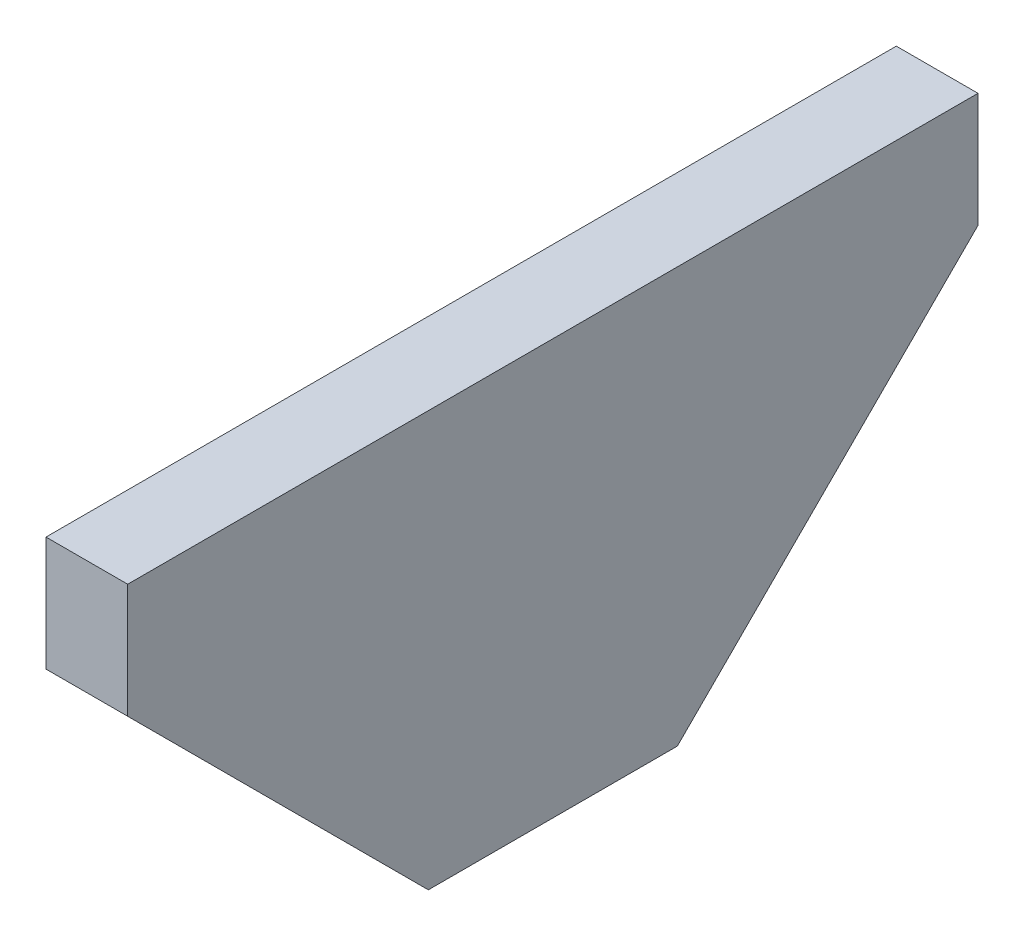
ISO-10303-21;
HEADER;
FILE_DESCRIPTION(('STEP AP214'),'2;1');
FILE_NAME('part.step','',(''),(''),'','','');
FILE_SCHEMA(('AUTOMOTIVE_DESIGN { 1 0 10303 214 1 1 1 1 }'));
ENDSEC;
DATA;
#1=APPLICATION_CONTEXT('core data for automotive mechanical design processes');
#2=APPLICATION_PROTOCOL_DEFINITION('international standard','automotive_design',2000,#1);
#3=PRODUCT_CONTEXT('',#1,'mechanical');
#4=PRODUCT('Part','Part','',(#3));
#5=PRODUCT_RELATED_PRODUCT_CATEGORY('part','',(#4));
#6=PRODUCT_DEFINITION_FORMATION('','',#4);
#7=PRODUCT_DEFINITION_CONTEXT('part definition',#1,'design');
#8=PRODUCT_DEFINITION('design','',#6,#7);
#9=PRODUCT_DEFINITION_SHAPE('','',#8);
#10=(LENGTH_UNIT() NAMED_UNIT(*) SI_UNIT(.MILLI.,.METRE.));
#11=(NAMED_UNIT(*) PLANE_ANGLE_UNIT() SI_UNIT($,.RADIAN.));
#12=(NAMED_UNIT(*) SI_UNIT($,.STERADIAN.) SOLID_ANGLE_UNIT());
#13=UNCERTAINTY_MEASURE_WITH_UNIT(LENGTH_MEASURE(1.E-05),#10,'distance_accuracy_value','');
#14=(GEOMETRIC_REPRESENTATION_CONTEXT(3) GLOBAL_UNCERTAINTY_ASSIGNED_CONTEXT((#13)) GLOBAL_UNIT_ASSIGNED_CONTEXT((#10,
#11,#12)) REPRESENTATION_CONTEXT('',''));
#15=CARTESIAN_POINT('',(0.,0.,0.));
#16=DIRECTION('',(0.,0.,1.));
#17=DIRECTION('',(1.,0.,0.));
#18=AXIS2_PLACEMENT_3D('',#15,#16,#17);
#19=CARTESIAN_POINT('',(-21.0781796503859,12.7,0.));
#20=DIRECTION('',(1.,0.,0.));
#21=DIRECTION('',(0.,0.,-1.));
#22=AXIS2_PLACEMENT_3D('',#19,#20,#21);
#23=PLANE('',#22);
#24=CARTESIAN_POINT('',(-21.0781796503859,9.2,15.2058038197349));
#25=DIRECTION('',(1.,0.,0.));
#26=DIRECTION('',(0.,0.,-1.));
#27=AXIS2_PLACEMENT_3D('',#24,#25,#26);
#28=CIRCLE('',#27,1.75);
#29=CARTESIAN_POINT('',(-21.0781796503859,9.2,13.4558038197349));
#30=VERTEX_POINT('',#29);
#31=EDGE_CURVE('E147',#30,#30,#28,.T.);
#32=ORIENTED_EDGE('',*,*,#31,.T.);
#33=EDGE_LOOP('',(#32));
#34=FACE_BOUND('',#33,.T.);
#35=DIRECTION('',(0.,0.,1.));
#36=VECTOR('',#35,1.);
#37=CARTESIAN_POINT('',(-21.0781796503859,12.7,0.));
#38=LINE('',#37,#36);
#39=CARTESIAN_POINT('',(-21.0781796503859,12.7,-7.56419618026506));
#40=VERTEX_POINT('',#39);
#41=CARTESIAN_POINT('',(-21.0781796503859,12.7,18.4558038197349));
#42=VERTEX_POINT('',#41);
#43=EDGE_CURVE('E109',#40,#42,#38,.T.);
#44=ORIENTED_EDGE('',*,*,#43,.F.);
#45=DIRECTION('',(0.,-1.,0.));
#46=VECTOR('',#45,1.);
#47=CARTESIAN_POINT('',(-21.0781796503859,12.7,-7.56419618026506));
#48=LINE('',#47,#46);
#49=CARTESIAN_POINT('',(-21.0781796503859,9.19999999999999,-7.56419618026506));
#50=VERTEX_POINT('',#49);
#51=EDGE_CURVE('E118',#40,#50,#48,.T.);
#52=ORIENTED_EDGE('',*,*,#51,.T.);
#53=DIRECTION('',(0.,-0.707106781186551,0.707106781186544));
#54=VECTOR('',#53,1.);
#55=CARTESIAN_POINT('',(-21.0781796503859,1.72209809013254,-0.0862942703976841));
#56=LINE('',#55,#54);
#57=CARTESIAN_POINT('',(-21.0781796503859,0.,1.63580381973484));
#58=VERTEX_POINT('',#57);
#59=EDGE_CURVE('E128',#50,#58,#56,.T.);
#60=ORIENTED_EDGE('',*,*,#59,.T.);
#61=DIRECTION('',(0.,0.,1.));
#62=VECTOR('',#61,1.);
#63=CARTESIAN_POINT('',(-21.0781796503859,0.,0.));
#64=LINE('',#63,#62);
#65=CARTESIAN_POINT('',(-21.0781796503859,0.,9.25580381973504));
#66=VERTEX_POINT('',#65);
#67=EDGE_CURVE('E61',#58,#66,#64,.T.);
#68=ORIENTED_EDGE('',*,*,#67,.T.);
#69=DIRECTION('',(0.,-0.707106781186551,-0.707106781186544));
#70=VECTOR('',#69,1.);
#71=CARTESIAN_POINT('',(-21.0781796503859,1.72209809013254,10.9779019098676));
#72=LINE('',#71,#70);
#73=CARTESIAN_POINT('',(-21.0781796503859,9.2,18.4558038197349));
#74=VERTEX_POINT('',#73);
#75=EDGE_CURVE('E160',#74,#66,#72,.T.);
#76=ORIENTED_EDGE('',*,*,#75,.F.);
#77=DIRECTION('',(0.,-1.,0.));
#78=VECTOR('',#77,1.);
#79=CARTESIAN_POINT('',(-21.0781796503859,12.7,18.4558038197349));
#80=LINE('',#79,#78);
#81=EDGE_CURVE('E54',#42,#74,#80,.T.);
#82=ORIENTED_EDGE('',*,*,#81,.F.);
#83=EDGE_LOOP('',(#44,#52,#60,#68,#76,#82));
#84=FACE_BOUND('',#83,.T.);
#85=CARTESIAN_POINT('',(-21.0781796503859,9.2,-4.31419618026505));
#86=DIRECTION('',(-1.,0.,0.));
#87=DIRECTION('',(0.,0.,1.));
#88=AXIS2_PLACEMENT_3D('',#85,#86,#87);
#89=CIRCLE('',#88,1.75);
#90=CARTESIAN_POINT('',(-21.0781796503859,9.2,-2.56419618026505));
#91=VERTEX_POINT('',#90);
#92=EDGE_CURVE('E124',#91,#91,#89,.T.);
#93=ORIENTED_EDGE('',*,*,#92,.F.);
#94=EDGE_LOOP('',(#93));
#95=FACE_BOUND('',#94,.T.);
#96=ADVANCED_FACE('F46',(#34,#84,#95),#23,.F.);
#97=CARTESIAN_POINT('',(0.,12.7,18.4558038197349));
#98=DIRECTION('',(0.,0.,-1.));
#99=DIRECTION('',(-1.,0.,0.));
#100=AXIS2_PLACEMENT_3D('',#97,#98,#99);
#101=PLANE('',#100);
#102=DIRECTION('',(1.,0.,0.));
#103=VECTOR('',#102,1.);
#104=CARTESIAN_POINT('',(-21.5781796503859,9.2,18.4558038197349));
#105=LINE('',#104,#103);
#106=CARTESIAN_POINT('',(-18.5781796503859,9.2,18.4558038197349));
#107=VERTEX_POINT('',#106);
#108=EDGE_CURVE('E156',#74,#107,#105,.T.);
#109=ORIENTED_EDGE('',*,*,#108,.T.);
#110=DIRECTION('',(0.,-1.,0.));
#111=VECTOR('',#110,1.);
#112=CARTESIAN_POINT('',(-18.5781796503859,12.7,18.4558038197349));
#113=LINE('',#112,#111);
#114=CARTESIAN_POINT('',(-18.5781796503859,12.7,18.4558038197349));
#115=VERTEX_POINT('',#114);
#116=EDGE_CURVE('E170',#115,#107,#113,.T.);
#117=ORIENTED_EDGE('',*,*,#116,.F.);
#118=DIRECTION('',(1.,0.,0.));
#119=VECTOR('',#118,1.);
#120=CARTESIAN_POINT('',(0.,12.7,18.4558038197349));
#121=LINE('',#120,#119);
#122=EDGE_CURVE('E165',#42,#115,#121,.T.);
#123=ORIENTED_EDGE('',*,*,#122,.F.);
#124=ORIENTED_EDGE('',*,*,#81,.T.);
#125=EDGE_LOOP('',(#109,#117,#123,#124));
#126=FACE_BOUND('',#125,.T.);
#127=ADVANCED_FACE('F179',(#126),#101,.F.);
#128=CARTESIAN_POINT('',(-18.5781796503859,12.7,0.));
#129=DIRECTION('',(1.,0.,0.));
#130=DIRECTION('',(0.,0.,-1.));
#131=AXIS2_PLACEMENT_3D('',#128,#129,#130);
#132=PLANE('',#131);
#133=DIRECTION('',(0.,0.,1.));
#134=VECTOR('',#133,1.);
#135=CARTESIAN_POINT('',(-18.5781796503859,0.,0.));
#136=LINE('',#135,#134);
#137=CARTESIAN_POINT('',(-18.5781796503859,0.,1.63580381973485));
#138=VERTEX_POINT('',#137);
#139=CARTESIAN_POINT('',(-18.5781796503859,0.,9.25580381973504));
#140=VERTEX_POINT('',#139);
#141=EDGE_CURVE('E99',#138,#140,#136,.T.);
#142=ORIENTED_EDGE('',*,*,#141,.F.);
#143=DIRECTION('',(0.,-0.707106781186551,0.707106781186544));
#144=VECTOR('',#143,1.);
#145=CARTESIAN_POINT('',(-18.5781796503859,9.19999999999999,-7.56419618026506));
#146=LINE('',#145,#144);
#147=CARTESIAN_POINT('',(-18.5781796503859,9.19999999999999,-7.56419618026506));
#148=VERTEX_POINT('',#147);
#149=EDGE_CURVE('E103',#148,#138,#146,.T.);
#150=ORIENTED_EDGE('',*,*,#149,.F.);
#151=DIRECTION('',(0.,-1.,0.));
#152=VECTOR('',#151,1.);
#153=CARTESIAN_POINT('',(-18.5781796503859,12.7,-7.56419618026506));
#154=LINE('',#153,#152);
#155=CARTESIAN_POINT('',(-18.5781796503859,12.7,-7.56419618026506));
#156=VERTEX_POINT('',#155);
#157=EDGE_CURVE('E141',#156,#148,#154,.T.);
#158=ORIENTED_EDGE('',*,*,#157,.F.);
#159=DIRECTION('',(0.,0.,1.));
#160=VECTOR('',#159,1.);
#161=CARTESIAN_POINT('',(-18.5781796503859,12.7,0.));
#162=LINE('',#161,#160);
#163=EDGE_CURVE('E69',#156,#115,#162,.T.);
#164=ORIENTED_EDGE('',*,*,#163,.T.);
#165=ORIENTED_EDGE('',*,*,#116,.T.);
#166=DIRECTION('',(0.,-0.707106781186551,-0.707106781186544));
#167=VECTOR('',#166,1.);
#168=CARTESIAN_POINT('',(-18.5781796503859,9.2,18.4558038197349));
#169=LINE('',#168,#167);
#170=EDGE_CURVE('E105',#107,#140,#169,.T.);
#171=ORIENTED_EDGE('',*,*,#170,.T.);
#172=EDGE_LOOP('',(#142,#150,#158,#164,#165,#171));
#173=FACE_BOUND('',#172,.T.);
#174=ADVANCED_FACE('F101',(#173),#132,.T.);
#175=CARTESIAN_POINT('',(0.,0.,0.));
#176=DIRECTION('',(0.,1.,0.));
#177=DIRECTION('',(0.,0.,1.));
#178=AXIS2_PLACEMENT_3D('',#175,#176,#177);
#179=PLANE('',#178);
#180=ORIENTED_EDGE('',*,*,#67,.F.);
#181=DIRECTION('',(1.,0.,0.));
#182=VECTOR('',#181,1.);
#183=CARTESIAN_POINT('',(0.,0.,1.63580381973486));
#184=LINE('',#183,#182);
#185=EDGE_CURVE('E112',#58,#138,#184,.T.);
#186=ORIENTED_EDGE('',*,*,#185,.T.);
#187=ORIENTED_EDGE('',*,*,#141,.T.);
#188=DIRECTION('',(1.,0.,0.));
#189=VECTOR('',#188,1.);
#190=CARTESIAN_POINT('',(0.,0.,9.25580381973504));
#191=LINE('',#190,#189);
#192=EDGE_CURVE('E11',#66,#140,#191,.T.);
#193=ORIENTED_EDGE('',*,*,#192,.F.);
#194=EDGE_LOOP('',(#180,#186,#187,#193));
#195=FACE_BOUND('',#194,.T.);
#196=ADVANCED_FACE('F113',(#195),#179,.F.);
#197=CARTESIAN_POINT('',(-21.5781796503859,9.2,18.4558038197349));
#198=DIRECTION('',(0.,-0.707106781186544,0.707106781186551));
#199=DIRECTION('',(0.,-0.707106781186551,-0.707106781186544));
#200=AXIS2_PLACEMENT_3D('',#197,#198,#199);
#201=PLANE('',#200);
#202=ORIENTED_EDGE('',*,*,#75,.T.);
#203=ORIENTED_EDGE('',*,*,#192,.T.);
#204=ORIENTED_EDGE('',*,*,#170,.F.);
#205=ORIENTED_EDGE('',*,*,#108,.F.);
#206=EDGE_LOOP('',(#202,#203,#204,#205));
#207=FACE_BOUND('',#206,.T.);
#208=ADVANCED_FACE('F184',(#207),#201,.T.);
#209=CARTESIAN_POINT('',(0.,12.7,0.));
#210=DIRECTION('',(0.,1.,0.));
#211=DIRECTION('',(0.,0.,1.));
#212=AXIS2_PLACEMENT_3D('',#209,#210,#211);
#213=PLANE('',#212);
#214=ORIENTED_EDGE('',*,*,#163,.F.);
#215=DIRECTION('',(1.,0.,0.));
#216=VECTOR('',#215,1.);
#217=CARTESIAN_POINT('',(0.,12.7,-7.56419618026505));
#218=LINE('',#217,#216);
#219=EDGE_CURVE('E137',#40,#156,#218,.T.);
#220=ORIENTED_EDGE('',*,*,#219,.F.);
#221=ORIENTED_EDGE('',*,*,#43,.T.);
#222=ORIENTED_EDGE('',*,*,#122,.T.);
#223=EDGE_LOOP('',(#214,#220,#221,#222));
#224=FACE_BOUND('',#223,.T.);
#225=ADVANCED_FACE('F186',(#224),#213,.T.);
#226=CARTESIAN_POINT('',(-19.5781796503859,9.2,15.2058038197349));
#227=DIRECTION('',(-1.,0.,0.));
#228=DIRECTION('',(0.,0.,1.));
#229=AXIS2_PLACEMENT_3D('',#226,#227,#228);
#230=CYLINDRICAL_SURFACE('',#229,1.75);
#231=CARTESIAN_POINT('',(-19.5781796503859,9.2,15.2058038197349));
#232=DIRECTION('',(1.,0.,0.));
#233=DIRECTION('',(0.,0.,-1.));
#234=AXIS2_PLACEMENT_3D('',#231,#232,#233);
#235=CIRCLE('',#234,1.75);
#236=CARTESIAN_POINT('',(-19.5781796503859,9.2,13.4558038197349));
#237=VERTEX_POINT('',#236);
#238=EDGE_CURVE('E117',#237,#237,#235,.T.);
#239=ORIENTED_EDGE('',*,*,#238,.T.);
#240=EDGE_LOOP('',(#239));
#241=FACE_BOUND('',#240,.T.);
#242=ORIENTED_EDGE('',*,*,#31,.F.);
#243=EDGE_LOOP('',(#242));
#244=FACE_BOUND('',#243,.T.);
#245=ADVANCED_FACE('F192',(#241,#244),#230,.F.);
#246=CARTESIAN_POINT('',(-19.5781796503859,9.2,15.2058038197349));
#247=DIRECTION('',(1.,0.,0.));
#248=DIRECTION('',(0.,0.,-1.));
#249=AXIS2_PLACEMENT_3D('',#246,#247,#248);
#250=PLANE('',#249);
#251=ORIENTED_EDGE('',*,*,#238,.F.);
#252=EDGE_LOOP('',(#251));
#253=FACE_BOUND('',#252,.T.);
#254=ADVANCED_FACE('F205',(#253),#250,.F.);
#255=CARTESIAN_POINT('',(0.,12.7,-7.56419618026505));
#256=DIRECTION('',(0.,0.,1.));
#257=DIRECTION('',(-1.,0.,0.));
#258=AXIS2_PLACEMENT_3D('',#255,#256,#257);
#259=PLANE('',#258);
#260=DIRECTION('',(1.,0.,0.));
#261=VECTOR('',#260,1.);
#262=CARTESIAN_POINT('',(-21.5781796503859,9.19999999999999,-7.56419618026506));
#263=LINE('',#262,#261);
#264=EDGE_CURVE('E122',#50,#148,#263,.T.);
#265=ORIENTED_EDGE('',*,*,#264,.F.);
#266=ORIENTED_EDGE('',*,*,#51,.F.);
#267=ORIENTED_EDGE('',*,*,#219,.T.);
#268=ORIENTED_EDGE('',*,*,#157,.T.);
#269=EDGE_LOOP('',(#265,#266,#267,#268));
#270=FACE_BOUND('',#269,.T.);
#271=ADVANCED_FACE('F211',(#270),#259,.F.);
#272=CARTESIAN_POINT('',(-21.5781796503859,9.19999999999999,-7.56419618026506));
#273=DIRECTION('',(0.,-0.707106781186544,-0.707106781186551));
#274=DIRECTION('',(0.,-0.707106781186551,0.707106781186544));
#275=AXIS2_PLACEMENT_3D('',#272,#273,#274);
#276=PLANE('',#275);
#277=ORIENTED_EDGE('',*,*,#59,.F.);
#278=ORIENTED_EDGE('',*,*,#264,.T.);
#279=ORIENTED_EDGE('',*,*,#149,.T.);
#280=ORIENTED_EDGE('',*,*,#185,.F.);
#281=EDGE_LOOP('',(#277,#278,#279,#280));
#282=FACE_BOUND('',#281,.T.);
#283=ADVANCED_FACE('F121',(#282),#276,.T.);
#284=CARTESIAN_POINT('',(-19.5781796503859,9.2,-4.31419618026505));
#285=DIRECTION('',(-1.,0.,0.));
#286=DIRECTION('',(0.,0.,-1.));
#287=AXIS2_PLACEMENT_3D('',#284,#285,#286);
#288=CYLINDRICAL_SURFACE('',#287,1.75);
#289=CARTESIAN_POINT('',(-19.5781796503859,9.2,-4.31419618026505));
#290=DIRECTION('',(-1.,0.,0.));
#291=DIRECTION('',(0.,0.,1.));
#292=AXIS2_PLACEMENT_3D('',#289,#290,#291);
#293=CIRCLE('',#292,1.75);
#294=CARTESIAN_POINT('',(-19.5781796503859,9.2,-2.56419618026505));
#295=VERTEX_POINT('',#294);
#296=EDGE_CURVE('E131',#295,#295,#293,.T.);
#297=ORIENTED_EDGE('',*,*,#296,.F.);
#298=EDGE_LOOP('',(#297));
#299=FACE_BOUND('',#298,.T.);
#300=ORIENTED_EDGE('',*,*,#92,.T.);
#301=EDGE_LOOP('',(#300));
#302=FACE_BOUND('',#301,.T.);
#303=ADVANCED_FACE('F219',(#299,#302),#288,.F.);
#304=CARTESIAN_POINT('',(-19.5781796503859,9.2,-4.31419618026505));
#305=DIRECTION('',(1.,0.,0.));
#306=DIRECTION('',(0.,0.,1.));
#307=AXIS2_PLACEMENT_3D('',#304,#305,#306);
#308=PLANE('',#307);
#309=ORIENTED_EDGE('',*,*,#296,.T.);
#310=EDGE_LOOP('',(#309));
#311=FACE_BOUND('',#310,.T.);
#312=ADVANCED_FACE('F220',(#311),#308,.F.);
#313=CLOSED_SHELL('',(#96,#127,#174,#196,#208,#225,#245,#254,#271,#283,#303,#312));
#314=MANIFOLD_SOLID_BREP('B2',#313);
#315=ADVANCED_BREP_SHAPE_REPRESENTATION('',(#18,#314),#14);
#316=SHAPE_DEFINITION_REPRESENTATION(#9,#315);
ENDSEC;
END-ISO-10303-21;
